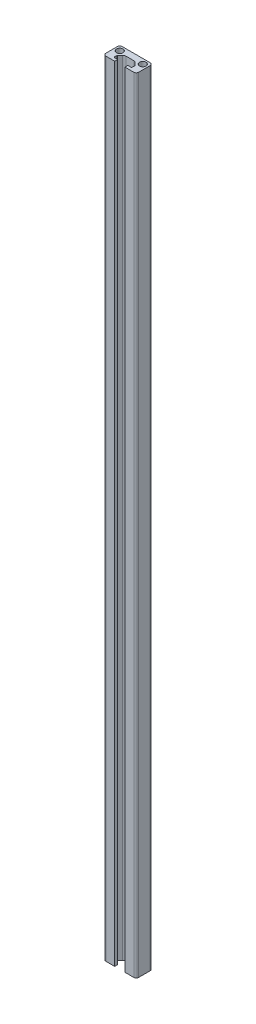
ISO-10303-21;
HEADER;
FILE_DESCRIPTION(('STEP AP214'),'2;1');
FILE_NAME('part.step','',(''),(''),'','','');
FILE_SCHEMA(('AUTOMOTIVE_DESIGN { 1 0 10303 214 1 1 1 1 }'));
ENDSEC;
DATA;
#1=APPLICATION_CONTEXT('core data for automotive mechanical design processes');
#2=APPLICATION_PROTOCOL_DEFINITION('international standard','automotive_design',2000,#1);
#3=PRODUCT_CONTEXT('',#1,'mechanical');
#4=PRODUCT('Part','Part','',(#3));
#5=PRODUCT_RELATED_PRODUCT_CATEGORY('part','',(#4));
#6=PRODUCT_DEFINITION_FORMATION('','',#4);
#7=PRODUCT_DEFINITION_CONTEXT('part definition',#1,'design');
#8=PRODUCT_DEFINITION('design','',#6,#7);
#9=PRODUCT_DEFINITION_SHAPE('','',#8);
#10=(LENGTH_UNIT() NAMED_UNIT(*) SI_UNIT(.MILLI.,.METRE.));
#11=(NAMED_UNIT(*) PLANE_ANGLE_UNIT() SI_UNIT($,.RADIAN.));
#12=(NAMED_UNIT(*) SI_UNIT($,.STERADIAN.) SOLID_ANGLE_UNIT());
#13=UNCERTAINTY_MEASURE_WITH_UNIT(LENGTH_MEASURE(1.E-05),#10,'distance_accuracy_value','');
#14=(GEOMETRIC_REPRESENTATION_CONTEXT(3) GLOBAL_UNCERTAINTY_ASSIGNED_CONTEXT((#13)) GLOBAL_UNIT_ASSIGNED_CONTEXT((#10,
#11,#12)) REPRESENTATION_CONTEXT('',''));
#15=CARTESIAN_POINT('',(0.,0.,0.));
#16=DIRECTION('',(0.,0.,1.));
#17=DIRECTION('',(1.,0.,0.));
#18=AXIS2_PLACEMENT_3D('',#15,#16,#17);
#19=CARTESIAN_POINT('',(-3.1,-238.5,0.));
#20=DIRECTION('',(1.,0.,0.));
#21=DIRECTION('',(0.,0.,-1.));
#22=AXIS2_PLACEMENT_3D('',#19,#20,#21);
#23=PLANE('',#22);
#24=DIRECTION('',(0.,0.,-1.));
#25=VECTOR('',#24,1.);
#26=CARTESIAN_POINT('',(-3.1,238.5,0.));
#27=LINE('',#26,#25);
#28=CARTESIAN_POINT('',(-3.1,238.5,0.));
#29=VERTEX_POINT('',#28);
#30=CARTESIAN_POINT('',(-3.1,238.5,-1.8));
#31=VERTEX_POINT('',#30);
#32=EDGE_CURVE('E230',#29,#31,#27,.T.);
#33=ORIENTED_EDGE('',*,*,#32,.F.);
#34=DIRECTION('',(0.,1.,0.));
#35=VECTOR('',#34,1.);
#36=CARTESIAN_POINT('',(-3.1,-238.5,0.));
#37=LINE('',#36,#35);
#38=CARTESIAN_POINT('',(-3.1,-238.5,0.));
#39=VERTEX_POINT('',#38);
#40=EDGE_CURVE('E11',#39,#29,#37,.T.);
#41=ORIENTED_EDGE('',*,*,#40,.F.);
#42=DIRECTION('',(0.,0.,-1.));
#43=VECTOR('',#42,1.);
#44=CARTESIAN_POINT('',(-3.1,-238.5,0.));
#45=LINE('',#44,#43);
#46=CARTESIAN_POINT('',(-3.1,-238.5,-1.8));
#47=VERTEX_POINT('',#46);
#48=EDGE_CURVE('E299',#39,#47,#45,.T.);
#49=ORIENTED_EDGE('',*,*,#48,.T.);
#50=DIRECTION('',(0.,1.,0.));
#51=VECTOR('',#50,1.);
#52=CARTESIAN_POINT('',(-3.1,-238.5,-1.8));
#53=LINE('',#52,#51);
#54=EDGE_CURVE('E40',#47,#31,#53,.T.);
#55=ORIENTED_EDGE('',*,*,#54,.T.);
#56=EDGE_LOOP('',(#33,#41,#49,#55));
#57=FACE_BOUND('',#56,.T.);
#58=ADVANCED_FACE('F37',(#57),#23,.T.);
#59=CARTESIAN_POINT('',(-8.5,-238.5,0.));
#60=DIRECTION('',(0.,0.,1.));
#61=DIRECTION('',(1.,0.,0.));
#62=AXIS2_PLACEMENT_3D('',#59,#60,#61);
#63=PLANE('',#62);
#64=DIRECTION('',(1.,0.,0.));
#65=VECTOR('',#64,1.);
#66=CARTESIAN_POINT('',(-8.5,238.5,0.));
#67=LINE('',#66,#65);
#68=CARTESIAN_POINT('',(-8.5,238.5,0.));
#69=VERTEX_POINT('',#68);
#70=EDGE_CURVE('E297',#69,#29,#67,.T.);
#71=ORIENTED_EDGE('',*,*,#70,.F.);
#72=DIRECTION('',(0.,1.,0.));
#73=VECTOR('',#72,1.);
#74=CARTESIAN_POINT('',(-8.5,-238.5,0.));
#75=LINE('',#74,#73);
#76=CARTESIAN_POINT('',(-8.5,-238.5,0.));
#77=VERTEX_POINT('',#76);
#78=EDGE_CURVE('E46',#77,#69,#75,.T.);
#79=ORIENTED_EDGE('',*,*,#78,.F.);
#80=DIRECTION('',(1.,0.,0.));
#81=VECTOR('',#80,1.);
#82=CARTESIAN_POINT('',(-8.5,-238.5,0.));
#83=LINE('',#82,#81);
#84=EDGE_CURVE('E220',#77,#39,#83,.T.);
#85=ORIENTED_EDGE('',*,*,#84,.T.);
#86=ORIENTED_EDGE('',*,*,#40,.T.);
#87=EDGE_LOOP('',(#71,#79,#85,#86));
#88=FACE_BOUND('',#87,.T.);
#89=ADVANCED_FACE('F343',(#88),#63,.T.);
#90=CARTESIAN_POINT('',(-8.5,-238.5,-1.5));
#91=DIRECTION('',(0.,1.,0.));
#92=DIRECTION('',(0.,0.,1.));
#93=AXIS2_PLACEMENT_3D('',#90,#91,#92);
#94=CYLINDRICAL_SURFACE('',#93,1.5);
#95=CARTESIAN_POINT('',(-8.5,238.5,-1.5));
#96=DIRECTION('',(0.,1.,0.));
#97=DIRECTION('',(0.,0.,1.));
#98=AXIS2_PLACEMENT_3D('',#95,#96,#97);
#99=CIRCLE('',#98,1.5);
#100=CARTESIAN_POINT('',(-10.,238.5,-1.5));
#101=VERTEX_POINT('',#100);
#102=EDGE_CURVE('E207',#101,#69,#99,.T.);
#103=ORIENTED_EDGE('',*,*,#102,.F.);
#104=DIRECTION('',(0.,1.,0.));
#105=VECTOR('',#104,1.);
#106=CARTESIAN_POINT('',(-10.,-238.5,-1.5));
#107=LINE('',#106,#105);
#108=CARTESIAN_POINT('',(-10.,-238.5,-1.5));
#109=VERTEX_POINT('',#108);
#110=EDGE_CURVE('E202',#109,#101,#107,.T.);
#111=ORIENTED_EDGE('',*,*,#110,.F.);
#112=CARTESIAN_POINT('',(-8.5,-238.5,-1.5));
#113=DIRECTION('',(0.,1.,0.));
#114=DIRECTION('',(0.,0.,1.));
#115=AXIS2_PLACEMENT_3D('',#112,#113,#114);
#116=CIRCLE('',#115,1.5);
#117=EDGE_CURVE('E205',#109,#77,#116,.T.);
#118=ORIENTED_EDGE('',*,*,#117,.T.);
#119=ORIENTED_EDGE('',*,*,#78,.T.);
#120=EDGE_LOOP('',(#103,#111,#118,#119));
#121=FACE_BOUND('',#120,.T.);
#122=ADVANCED_FACE('F204',(#121),#94,.T.);
#123=CARTESIAN_POINT('',(-10.,-238.5,-8.5));
#124=DIRECTION('',(-1.,0.,0.));
#125=DIRECTION('',(0.,0.,1.));
#126=AXIS2_PLACEMENT_3D('',#123,#124,#125);
#127=PLANE('',#126);
#128=DIRECTION('',(0.,0.,1.));
#129=VECTOR('',#128,1.);
#130=CARTESIAN_POINT('',(-10.,238.5,-8.5));
#131=LINE('',#130,#129);
#132=CARTESIAN_POINT('',(-10.,238.5,-8.5));
#133=VERTEX_POINT('',#132);
#134=EDGE_CURVE('E294',#133,#101,#131,.T.);
#135=ORIENTED_EDGE('',*,*,#134,.F.);
#136=DIRECTION('',(0.,1.,0.));
#137=VECTOR('',#136,1.);
#138=CARTESIAN_POINT('',(-10.,-238.5,-8.5));
#139=LINE('',#138,#137);
#140=CARTESIAN_POINT('',(-10.,-238.5,-8.5));
#141=VERTEX_POINT('',#140);
#142=EDGE_CURVE('E212',#141,#133,#139,.T.);
#143=ORIENTED_EDGE('',*,*,#142,.F.);
#144=DIRECTION('',(0.,0.,1.));
#145=VECTOR('',#144,1.);
#146=CARTESIAN_POINT('',(-10.,-238.5,-8.5));
#147=LINE('',#146,#145);
#148=EDGE_CURVE('E218',#141,#109,#147,.T.);
#149=ORIENTED_EDGE('',*,*,#148,.T.);
#150=ORIENTED_EDGE('',*,*,#110,.T.);
#151=EDGE_LOOP('',(#135,#143,#149,#150));
#152=FACE_BOUND('',#151,.T.);
#153=ADVANCED_FACE('F222',(#152),#127,.T.);
#154=CARTESIAN_POINT('',(-8.5,-238.5,-8.5));
#155=DIRECTION('',(0.,1.,0.));
#156=DIRECTION('',(0.,0.,1.));
#157=AXIS2_PLACEMENT_3D('',#154,#155,#156);
#158=CYLINDRICAL_SURFACE('',#157,1.5);
#159=CARTESIAN_POINT('',(-8.5,238.5,-8.5));
#160=DIRECTION('',(0.,1.,0.));
#161=DIRECTION('',(0.,0.,1.));
#162=AXIS2_PLACEMENT_3D('',#159,#160,#161);
#163=CIRCLE('',#162,1.5);
#164=CARTESIAN_POINT('',(-8.5,238.5,-10.));
#165=VERTEX_POINT('',#164);
#166=EDGE_CURVE('E291',#165,#133,#163,.T.);
#167=ORIENTED_EDGE('',*,*,#166,.F.);
#168=DIRECTION('',(0.,1.,0.));
#169=VECTOR('',#168,1.);
#170=CARTESIAN_POINT('',(-8.5,-238.5,-10.));
#171=LINE('',#170,#169);
#172=CARTESIAN_POINT('',(-8.5,-238.5,-10.));
#173=VERTEX_POINT('',#172);
#174=EDGE_CURVE('E303',#173,#165,#171,.T.);
#175=ORIENTED_EDGE('',*,*,#174,.F.);
#176=CARTESIAN_POINT('',(-8.5,-238.5,-8.5));
#177=DIRECTION('',(0.,1.,0.));
#178=DIRECTION('',(0.,0.,1.));
#179=AXIS2_PLACEMENT_3D('',#176,#177,#178);
#180=CIRCLE('',#179,1.5);
#181=EDGE_CURVE('E223',#173,#141,#180,.T.);
#182=ORIENTED_EDGE('',*,*,#181,.T.);
#183=ORIENTED_EDGE('',*,*,#142,.T.);
#184=EDGE_LOOP('',(#167,#175,#182,#183));
#185=FACE_BOUND('',#184,.T.);
#186=ADVANCED_FACE('F356',(#185),#158,.T.);
#187=CARTESIAN_POINT('',(8.5,-238.5,-10.));
#188=DIRECTION('',(0.,0.,-1.));
#189=DIRECTION('',(-1.,0.,0.));
#190=AXIS2_PLACEMENT_3D('',#187,#188,#189);
#191=PLANE('',#190);
#192=DIRECTION('',(-1.,0.,0.));
#193=VECTOR('',#192,1.);
#194=CARTESIAN_POINT('',(8.5,238.5,-10.));
#195=LINE('',#194,#193);
#196=CARTESIAN_POINT('',(8.5,238.5,-10.));
#197=VERTEX_POINT('',#196);
#198=EDGE_CURVE('E288',#197,#165,#195,.T.);
#199=ORIENTED_EDGE('',*,*,#198,.F.);
#200=DIRECTION('',(0.,1.,0.));
#201=VECTOR('',#200,1.);
#202=CARTESIAN_POINT('',(8.5,-238.5,-10.));
#203=LINE('',#202,#201);
#204=CARTESIAN_POINT('',(8.5,-238.5,-10.));
#205=VERTEX_POINT('',#204);
#206=EDGE_CURVE('E305',#205,#197,#203,.T.);
#207=ORIENTED_EDGE('',*,*,#206,.F.);
#208=DIRECTION('',(-1.,0.,0.));
#209=VECTOR('',#208,1.);
#210=CARTESIAN_POINT('',(8.5,-238.5,-10.));
#211=LINE('',#210,#209);
#212=EDGE_CURVE('E225',#205,#173,#211,.T.);
#213=ORIENTED_EDGE('',*,*,#212,.T.);
#214=ORIENTED_EDGE('',*,*,#174,.T.);
#215=EDGE_LOOP('',(#199,#207,#213,#214));
#216=FACE_BOUND('',#215,.T.);
#217=ADVANCED_FACE('F359',(#216),#191,.T.);
#218=CARTESIAN_POINT('',(8.5,-238.5,-8.5));
#219=DIRECTION('',(0.,1.,0.));
#220=DIRECTION('',(0.,0.,1.));
#221=AXIS2_PLACEMENT_3D('',#218,#219,#220);
#222=CYLINDRICAL_SURFACE('',#221,1.5);
#223=CARTESIAN_POINT('',(8.5,238.5,-8.5));
#224=DIRECTION('',(0.,1.,0.));
#225=DIRECTION('',(0.,0.,1.));
#226=AXIS2_PLACEMENT_3D('',#223,#224,#225);
#227=CIRCLE('',#226,1.5);
#228=CARTESIAN_POINT('',(10.,238.5,-8.5));
#229=VERTEX_POINT('',#228);
#230=EDGE_CURVE('E285',#229,#197,#227,.T.);
#231=ORIENTED_EDGE('',*,*,#230,.F.);
#232=DIRECTION('',(0.,1.,0.));
#233=VECTOR('',#232,1.);
#234=CARTESIAN_POINT('',(10.,-238.5,-8.5));
#235=LINE('',#234,#233);
#236=CARTESIAN_POINT('',(10.,-238.5,-8.5));
#237=VERTEX_POINT('',#236);
#238=EDGE_CURVE('E307',#237,#229,#235,.T.);
#239=ORIENTED_EDGE('',*,*,#238,.F.);
#240=CARTESIAN_POINT('',(8.5,-238.5,-8.5));
#241=DIRECTION('',(0.,1.,0.));
#242=DIRECTION('',(0.,0.,1.));
#243=AXIS2_PLACEMENT_3D('',#240,#241,#242);
#244=CIRCLE('',#243,1.5);
#245=EDGE_CURVE('E517',#237,#205,#244,.T.);
#246=ORIENTED_EDGE('',*,*,#245,.T.);
#247=ORIENTED_EDGE('',*,*,#206,.T.);
#248=EDGE_LOOP('',(#231,#239,#246,#247));
#249=FACE_BOUND('',#248,.T.);
#250=ADVANCED_FACE('F363',(#249),#222,.T.);
#251=CARTESIAN_POINT('',(10.,-238.5,-1.5));
#252=DIRECTION('',(1.,0.,0.));
#253=DIRECTION('',(0.,0.,-1.));
#254=AXIS2_PLACEMENT_3D('',#251,#252,#253);
#255=PLANE('',#254);
#256=DIRECTION('',(0.,0.,-1.));
#257=VECTOR('',#256,1.);
#258=CARTESIAN_POINT('',(10.,238.5,-1.5));
#259=LINE('',#258,#257);
#260=CARTESIAN_POINT('',(10.,238.5,-1.5));
#261=VERTEX_POINT('',#260);
#262=EDGE_CURVE('E282',#261,#229,#259,.T.);
#263=ORIENTED_EDGE('',*,*,#262,.F.);
#264=DIRECTION('',(0.,1.,0.));
#265=VECTOR('',#264,1.);
#266=CARTESIAN_POINT('',(10.,-238.5,-1.5));
#267=LINE('',#266,#265);
#268=CARTESIAN_POINT('',(10.,-238.5,-1.5));
#269=VERTEX_POINT('',#268);
#270=EDGE_CURVE('E309',#269,#261,#267,.T.);
#271=ORIENTED_EDGE('',*,*,#270,.F.);
#272=DIRECTION('',(0.,0.,-1.));
#273=VECTOR('',#272,1.);
#274=CARTESIAN_POINT('',(10.,-238.5,-1.5));
#275=LINE('',#274,#273);
#276=EDGE_CURVE('E514',#269,#237,#275,.T.);
#277=ORIENTED_EDGE('',*,*,#276,.T.);
#278=ORIENTED_EDGE('',*,*,#238,.T.);
#279=EDGE_LOOP('',(#263,#271,#277,#278));
#280=FACE_BOUND('',#279,.T.);
#281=ADVANCED_FACE('F367',(#280),#255,.T.);
#282=CARTESIAN_POINT('',(8.5,-238.5,-1.5));
#283=DIRECTION('',(0.,1.,0.));
#284=DIRECTION('',(0.,0.,1.));
#285=AXIS2_PLACEMENT_3D('',#282,#283,#284);
#286=CYLINDRICAL_SURFACE('',#285,1.5);
#287=CARTESIAN_POINT('',(8.5,238.5,-1.5));
#288=DIRECTION('',(0.,1.,0.));
#289=DIRECTION('',(0.,0.,1.));
#290=AXIS2_PLACEMENT_3D('',#287,#288,#289);
#291=CIRCLE('',#290,1.5);
#292=CARTESIAN_POINT('',(8.5,238.5,0.));
#293=VERTEX_POINT('',#292);
#294=EDGE_CURVE('E279',#293,#261,#291,.T.);
#295=ORIENTED_EDGE('',*,*,#294,.F.);
#296=DIRECTION('',(0.,1.,0.));
#297=VECTOR('',#296,1.);
#298=CARTESIAN_POINT('',(8.5,-238.5,0.));
#299=LINE('',#298,#297);
#300=CARTESIAN_POINT('',(8.5,-238.5,0.));
#301=VERTEX_POINT('',#300);
#302=EDGE_CURVE('E311',#301,#293,#299,.T.);
#303=ORIENTED_EDGE('',*,*,#302,.F.);
#304=CARTESIAN_POINT('',(8.5,-238.5,-1.5));
#305=DIRECTION('',(0.,1.,0.));
#306=DIRECTION('',(0.,0.,1.));
#307=AXIS2_PLACEMENT_3D('',#304,#305,#306);
#308=CIRCLE('',#307,1.5);
#309=EDGE_CURVE('E511',#301,#269,#308,.T.);
#310=ORIENTED_EDGE('',*,*,#309,.T.);
#311=ORIENTED_EDGE('',*,*,#270,.T.);
#312=EDGE_LOOP('',(#295,#303,#310,#311));
#313=FACE_BOUND('',#312,.T.);
#314=ADVANCED_FACE('F371',(#313),#286,.T.);
#315=CARTESIAN_POINT('',(3.1,-238.5,0.));
#316=DIRECTION('',(0.,0.,1.));
#317=DIRECTION('',(1.,0.,0.));
#318=AXIS2_PLACEMENT_3D('',#315,#316,#317);
#319=PLANE('',#318);
#320=DIRECTION('',(1.,0.,0.));
#321=VECTOR('',#320,1.);
#322=CARTESIAN_POINT('',(3.1,238.5,0.));
#323=LINE('',#322,#321);
#324=CARTESIAN_POINT('',(3.1,238.5,0.));
#325=VERTEX_POINT('',#324);
#326=EDGE_CURVE('E276',#325,#293,#323,.T.);
#327=ORIENTED_EDGE('',*,*,#326,.F.);
#328=DIRECTION('',(0.,1.,0.));
#329=VECTOR('',#328,1.);
#330=CARTESIAN_POINT('',(3.1,-238.5,0.));
#331=LINE('',#330,#329);
#332=CARTESIAN_POINT('',(3.1,-238.5,0.));
#333=VERTEX_POINT('',#332);
#334=EDGE_CURVE('E313',#333,#325,#331,.T.);
#335=ORIENTED_EDGE('',*,*,#334,.F.);
#336=DIRECTION('',(1.,0.,0.));
#337=VECTOR('',#336,1.);
#338=CARTESIAN_POINT('',(3.1,-238.5,0.));
#339=LINE('',#338,#337);
#340=EDGE_CURVE('E508',#333,#301,#339,.T.);
#341=ORIENTED_EDGE('',*,*,#340,.T.);
#342=ORIENTED_EDGE('',*,*,#302,.T.);
#343=EDGE_LOOP('',(#327,#335,#341,#342));
#344=FACE_BOUND('',#343,.T.);
#345=ADVANCED_FACE('F375',(#344),#319,.T.);
#346=CARTESIAN_POINT('',(3.1,-238.5,-1.8));
#347=DIRECTION('',(-1.,0.,0.));
#348=DIRECTION('',(0.,0.,1.));
#349=AXIS2_PLACEMENT_3D('',#346,#347,#348);
#350=PLANE('',#349);
#351=DIRECTION('',(0.,0.,1.));
#352=VECTOR('',#351,1.);
#353=CARTESIAN_POINT('',(3.1,238.5,-1.8));
#354=LINE('',#353,#352);
#355=CARTESIAN_POINT('',(3.1,238.5,-1.8));
#356=VERTEX_POINT('',#355);
#357=EDGE_CURVE('E273',#356,#325,#354,.T.);
#358=ORIENTED_EDGE('',*,*,#357,.F.);
#359=DIRECTION('',(0.,1.,0.));
#360=VECTOR('',#359,1.);
#361=CARTESIAN_POINT('',(3.1,-238.5,-1.8));
#362=LINE('',#361,#360);
#363=CARTESIAN_POINT('',(3.1,-238.5,-1.8));
#364=VERTEX_POINT('',#363);
#365=EDGE_CURVE('E315',#364,#356,#362,.T.);
#366=ORIENTED_EDGE('',*,*,#365,.F.);
#367=DIRECTION('',(0.,0.,1.));
#368=VECTOR('',#367,1.);
#369=CARTESIAN_POINT('',(3.1,-238.5,-1.8));
#370=LINE('',#369,#368);
#371=EDGE_CURVE('E505',#364,#333,#370,.T.);
#372=ORIENTED_EDGE('',*,*,#371,.T.);
#373=ORIENTED_EDGE('',*,*,#334,.T.);
#374=EDGE_LOOP('',(#358,#366,#372,#373));
#375=FACE_BOUND('',#374,.T.);
#376=ADVANCED_FACE('F379',(#375),#350,.T.);
#377=CARTESIAN_POINT('',(4.95,-238.5,-1.8));
#378=DIRECTION('',(0.,0.,-1.));
#379=DIRECTION('',(-1.,0.,0.));
#380=AXIS2_PLACEMENT_3D('',#377,#378,#379);
#381=PLANE('',#380);
#382=DIRECTION('',(-1.,0.,0.));
#383=VECTOR('',#382,1.);
#384=CARTESIAN_POINT('',(4.95,238.5,-1.8));
#385=LINE('',#384,#383);
#386=CARTESIAN_POINT('',(4.95,238.5,-1.8));
#387=VERTEX_POINT('',#386);
#388=EDGE_CURVE('E270',#387,#356,#385,.T.);
#389=ORIENTED_EDGE('',*,*,#388,.F.);
#390=DIRECTION('',(0.,1.,0.));
#391=VECTOR('',#390,1.);
#392=CARTESIAN_POINT('',(4.95,-238.5,-1.8));
#393=LINE('',#392,#391);
#394=CARTESIAN_POINT('',(4.95,-238.5,-1.8));
#395=VERTEX_POINT('',#394);
#396=EDGE_CURVE('E317',#395,#387,#393,.T.);
#397=ORIENTED_EDGE('',*,*,#396,.F.);
#398=DIRECTION('',(-1.,0.,0.));
#399=VECTOR('',#398,1.);
#400=CARTESIAN_POINT('',(4.95,-238.5,-1.8));
#401=LINE('',#400,#399);
#402=EDGE_CURVE('E502',#395,#364,#401,.T.);
#403=ORIENTED_EDGE('',*,*,#402,.T.);
#404=ORIENTED_EDGE('',*,*,#365,.T.);
#405=EDGE_LOOP('',(#389,#397,#403,#404));
#406=FACE_BOUND('',#405,.T.);
#407=ADVANCED_FACE('F383',(#406),#381,.T.);
#408=CARTESIAN_POINT('',(4.95,-238.5,-2.3));
#409=DIRECTION('',(0.,1.,0.));
#410=DIRECTION('',(0.,0.,1.));
#411=AXIS2_PLACEMENT_3D('',#408,#409,#410);
#412=CYLINDRICAL_SURFACE('',#411,0.5);
#413=CARTESIAN_POINT('',(4.95,238.5,-2.3));
#414=DIRECTION('',(0.,-1.,0.));
#415=DIRECTION('',(0.,0.,-1.));
#416=AXIS2_PLACEMENT_3D('',#413,#414,#415);
#417=CIRCLE('',#416,0.5);
#418=CARTESIAN_POINT('',(5.45,238.5,-2.3));
#419=VERTEX_POINT('',#418);
#420=EDGE_CURVE('E267',#419,#387,#417,.T.);
#421=ORIENTED_EDGE('',*,*,#420,.F.);
#422=DIRECTION('',(0.,1.,0.));
#423=VECTOR('',#422,1.);
#424=CARTESIAN_POINT('',(5.45,-238.5,-2.3));
#425=LINE('',#424,#423);
#426=CARTESIAN_POINT('',(5.45,-238.5,-2.3));
#427=VERTEX_POINT('',#426);
#428=EDGE_CURVE('E319',#427,#419,#425,.T.);
#429=ORIENTED_EDGE('',*,*,#428,.F.);
#430=CARTESIAN_POINT('',(4.95,-238.5,-2.3));
#431=DIRECTION('',(0.,-1.,0.));
#432=DIRECTION('',(0.,0.,-1.));
#433=AXIS2_PLACEMENT_3D('',#430,#431,#432);
#434=CIRCLE('',#433,0.5);
#435=EDGE_CURVE('E499',#427,#395,#434,.T.);
#436=ORIENTED_EDGE('',*,*,#435,.T.);
#437=ORIENTED_EDGE('',*,*,#396,.T.);
#438=EDGE_LOOP('',(#421,#429,#436,#437));
#439=FACE_BOUND('',#438,.T.);
#440=ADVANCED_FACE('F387',(#439),#412,.F.);
#441=CARTESIAN_POINT('',(5.45,-238.5,-3.69289321881345));
#442=DIRECTION('',(-1.,0.,0.));
#443=DIRECTION('',(0.,0.,1.));
#444=AXIS2_PLACEMENT_3D('',#441,#442,#443);
#445=PLANE('',#444);
#446=DIRECTION('',(0.,0.,1.));
#447=VECTOR('',#446,1.);
#448=CARTESIAN_POINT('',(5.45,238.5,-3.69289321881345));
#449=LINE('',#448,#447);
#450=CARTESIAN_POINT('',(5.45,238.5,-3.69289321881345));
#451=VERTEX_POINT('',#450);
#452=EDGE_CURVE('E264',#451,#419,#449,.T.);
#453=ORIENTED_EDGE('',*,*,#452,.F.);
#454=DIRECTION('',(0.,1.,0.));
#455=VECTOR('',#454,1.);
#456=CARTESIAN_POINT('',(5.45,-238.5,-3.69289321881345));
#457=LINE('',#456,#455);
#458=CARTESIAN_POINT('',(5.45,-238.5,-3.69289321881345));
#459=VERTEX_POINT('',#458);
#460=EDGE_CURVE('E321',#459,#451,#457,.T.);
#461=ORIENTED_EDGE('',*,*,#460,.F.);
#462=DIRECTION('',(0.,0.,1.));
#463=VECTOR('',#462,1.);
#464=CARTESIAN_POINT('',(5.45,-238.5,-3.69289321881345));
#465=LINE('',#464,#463);
#466=EDGE_CURVE('E496',#459,#427,#465,.T.);
#467=ORIENTED_EDGE('',*,*,#466,.T.);
#468=ORIENTED_EDGE('',*,*,#428,.T.);
#469=EDGE_LOOP('',(#453,#461,#467,#468));
#470=FACE_BOUND('',#469,.T.);
#471=ADVANCED_FACE('F391',(#470),#445,.T.);
#472=CARTESIAN_POINT('',(4.95,-238.5,-3.69289321881345));
#473=DIRECTION('',(0.,1.,0.));
#474=DIRECTION('',(0.,0.,1.));
#475=AXIS2_PLACEMENT_3D('',#472,#473,#474);
#476=CYLINDRICAL_SURFACE('',#475,0.499999999999999);
#477=CARTESIAN_POINT('',(4.95,238.5,-3.69289321881345));
#478=DIRECTION('',(0.,-1.,0.));
#479=DIRECTION('',(0.,0.,-1.));
#480=AXIS2_PLACEMENT_3D('',#477,#478,#479);
#481=CIRCLE('',#480,0.499999999999999);
#482=CARTESIAN_POINT('',(5.30355339059327,238.5,-4.04644660940673));
#483=VERTEX_POINT('',#482);
#484=EDGE_CURVE('E261',#483,#451,#481,.T.);
#485=ORIENTED_EDGE('',*,*,#484,.F.);
#486=DIRECTION('',(0.,1.,0.));
#487=VECTOR('',#486,1.);
#488=CARTESIAN_POINT('',(5.30355339059327,-238.5,-4.04644660940673));
#489=LINE('',#488,#487);
#490=CARTESIAN_POINT('',(5.30355339059327,-238.5,-4.04644660940673));
#491=VERTEX_POINT('',#490);
#492=EDGE_CURVE('E323',#491,#483,#489,.T.);
#493=ORIENTED_EDGE('',*,*,#492,.F.);
#494=CARTESIAN_POINT('',(4.95,-238.5,-3.69289321881345));
#495=DIRECTION('',(0.,-1.,0.));
#496=DIRECTION('',(0.,0.,-1.));
#497=AXIS2_PLACEMENT_3D('',#494,#495,#496);
#498=CIRCLE('',#497,0.499999999999999);
#499=EDGE_CURVE('E493',#491,#459,#498,.T.);
#500=ORIENTED_EDGE('',*,*,#499,.T.);
#501=ORIENTED_EDGE('',*,*,#460,.T.);
#502=EDGE_LOOP('',(#485,#493,#500,#501));
#503=FACE_BOUND('',#502,.T.);
#504=ADVANCED_FACE('F395',(#503),#476,.F.);
#505=CARTESIAN_POINT('',(3.83578643762691,-238.5,-5.5142135623731));
#506=DIRECTION('',(-0.70710678118655,0.,0.707106781186545));
#507=DIRECTION('',(0.707106781186545,0.,0.70710678118655));
#508=AXIS2_PLACEMENT_3D('',#505,#506,#507);
#509=PLANE('',#508);
#510=DIRECTION('',(0.707106781186545,0.,0.70710678118655));
#511=VECTOR('',#510,1.);
#512=CARTESIAN_POINT('',(3.83578643762691,238.5,-5.5142135623731));
#513=LINE('',#512,#511);
#514=CARTESIAN_POINT('',(3.8357864376269,238.5,-5.5142135623731));
#515=VERTEX_POINT('',#514);
#516=EDGE_CURVE('E258',#515,#483,#513,.T.);
#517=ORIENTED_EDGE('',*,*,#516,.F.);
#518=DIRECTION('',(0.,1.,0.));
#519=VECTOR('',#518,1.);
#520=CARTESIAN_POINT('',(3.8357864376269,-238.5,-5.5142135623731));
#521=LINE('',#520,#519);
#522=CARTESIAN_POINT('',(3.8357864376269,-238.5,-5.5142135623731));
#523=VERTEX_POINT('',#522);
#524=EDGE_CURVE('E325',#523,#515,#521,.T.);
#525=ORIENTED_EDGE('',*,*,#524,.F.);
#526=DIRECTION('',(0.707106781186545,0.,0.70710678118655));
#527=VECTOR('',#526,1.);
#528=CARTESIAN_POINT('',(3.83578643762691,-238.5,-5.5142135623731));
#529=LINE('',#528,#527);
#530=EDGE_CURVE('E490',#523,#491,#529,.T.);
#531=ORIENTED_EDGE('',*,*,#530,.T.);
#532=ORIENTED_EDGE('',*,*,#492,.T.);
#533=EDGE_LOOP('',(#517,#525,#531,#532));
#534=FACE_BOUND('',#533,.T.);
#535=ADVANCED_FACE('F399',(#534),#509,.T.);
#536=CARTESIAN_POINT('',(2.42157287525381,-238.5,-4.1));
#537=DIRECTION('',(0.,1.,0.));
#538=DIRECTION('',(0.,0.,1.));
#539=AXIS2_PLACEMENT_3D('',#536,#537,#538);
#540=CYLINDRICAL_SURFACE('',#539,2.);
#541=CARTESIAN_POINT('',(2.42157287525381,238.5,-4.1));
#542=DIRECTION('',(0.,-1.,0.));
#543=DIRECTION('',(0.,0.,-1.));
#544=AXIS2_PLACEMENT_3D('',#541,#542,#543);
#545=CIRCLE('',#544,2.);
#546=CARTESIAN_POINT('',(2.42157287525381,238.5,-6.1));
#547=VERTEX_POINT('',#546);
#548=EDGE_CURVE('E255',#547,#515,#545,.T.);
#549=ORIENTED_EDGE('',*,*,#548,.F.);
#550=DIRECTION('',(0.,1.,0.));
#551=VECTOR('',#550,1.);
#552=CARTESIAN_POINT('',(2.42157287525381,-238.5,-6.1));
#553=LINE('',#552,#551);
#554=CARTESIAN_POINT('',(2.42157287525381,-238.5,-6.1));
#555=VERTEX_POINT('',#554);
#556=EDGE_CURVE('E327',#555,#547,#553,.T.);
#557=ORIENTED_EDGE('',*,*,#556,.F.);
#558=CARTESIAN_POINT('',(2.42157287525381,-238.5,-4.1));
#559=DIRECTION('',(0.,-1.,0.));
#560=DIRECTION('',(0.,0.,-1.));
#561=AXIS2_PLACEMENT_3D('',#558,#559,#560);
#562=CIRCLE('',#561,2.);
#563=EDGE_CURVE('E487',#555,#523,#562,.T.);
#564=ORIENTED_EDGE('',*,*,#563,.T.);
#565=ORIENTED_EDGE('',*,*,#524,.T.);
#566=EDGE_LOOP('',(#549,#557,#564,#565));
#567=FACE_BOUND('',#566,.T.);
#568=ADVANCED_FACE('F403',(#567),#540,.F.);
#569=CARTESIAN_POINT('',(-2.42157287525381,-238.5,-6.1));
#570=DIRECTION('',(0.,0.,1.));
#571=DIRECTION('',(1.,0.,0.));
#572=AXIS2_PLACEMENT_3D('',#569,#570,#571);
#573=PLANE('',#572);
#574=DIRECTION('',(1.,0.,0.));
#575=VECTOR('',#574,1.);
#576=CARTESIAN_POINT('',(-2.42157287525381,238.5,-6.1));
#577=LINE('',#576,#575);
#578=CARTESIAN_POINT('',(-2.42157287525381,238.5,-6.1));
#579=VERTEX_POINT('',#578);
#580=EDGE_CURVE('E252',#579,#547,#577,.T.);
#581=ORIENTED_EDGE('',*,*,#580,.F.);
#582=DIRECTION('',(0.,1.,0.));
#583=VECTOR('',#582,1.);
#584=CARTESIAN_POINT('',(-2.42157287525381,-238.5,-6.1));
#585=LINE('',#584,#583);
#586=CARTESIAN_POINT('',(-2.42157287525381,-238.5,-6.1));
#587=VERTEX_POINT('',#586);
#588=EDGE_CURVE('E329',#587,#579,#585,.T.);
#589=ORIENTED_EDGE('',*,*,#588,.F.);
#590=DIRECTION('',(1.,0.,0.));
#591=VECTOR('',#590,1.);
#592=CARTESIAN_POINT('',(-2.42157287525381,-238.5,-6.1));
#593=LINE('',#592,#591);
#594=EDGE_CURVE('E484',#587,#555,#593,.T.);
#595=ORIENTED_EDGE('',*,*,#594,.T.);
#596=ORIENTED_EDGE('',*,*,#556,.T.);
#597=EDGE_LOOP('',(#581,#589,#595,#596));
#598=FACE_BOUND('',#597,.T.);
#599=ADVANCED_FACE('F407',(#598),#573,.T.);
#600=CARTESIAN_POINT('',(-2.42157287525381,-238.5,-4.1));
#601=DIRECTION('',(0.,1.,0.));
#602=DIRECTION('',(0.,0.,1.));
#603=AXIS2_PLACEMENT_3D('',#600,#601,#602);
#604=CYLINDRICAL_SURFACE('',#603,2.);
#605=CARTESIAN_POINT('',(-2.42157287525381,238.5,-4.1));
#606=DIRECTION('',(0.,-1.,0.));
#607=DIRECTION('',(0.,0.,-1.));
#608=AXIS2_PLACEMENT_3D('',#605,#606,#607);
#609=CIRCLE('',#608,2.);
#610=CARTESIAN_POINT('',(-3.83578643762691,238.5,-5.5142135623731));
#611=VERTEX_POINT('',#610);
#612=EDGE_CURVE('E249',#611,#579,#609,.T.);
#613=ORIENTED_EDGE('',*,*,#612,.F.);
#614=DIRECTION('',(0.,1.,0.));
#615=VECTOR('',#614,1.);
#616=CARTESIAN_POINT('',(-3.83578643762691,-238.5,-5.5142135623731));
#617=LINE('',#616,#615);
#618=CARTESIAN_POINT('',(-3.83578643762691,-238.5,-5.5142135623731));
#619=VERTEX_POINT('',#618);
#620=EDGE_CURVE('E331',#619,#611,#617,.T.);
#621=ORIENTED_EDGE('',*,*,#620,.F.);
#622=CARTESIAN_POINT('',(-2.42157287525381,-238.5,-4.1));
#623=DIRECTION('',(0.,-1.,0.));
#624=DIRECTION('',(0.,0.,-1.));
#625=AXIS2_PLACEMENT_3D('',#622,#623,#624);
#626=CIRCLE('',#625,2.);
#627=EDGE_CURVE('E481',#619,#587,#626,.T.);
#628=ORIENTED_EDGE('',*,*,#627,.T.);
#629=ORIENTED_EDGE('',*,*,#588,.T.);
#630=EDGE_LOOP('',(#613,#621,#628,#629));
#631=FACE_BOUND('',#630,.T.);
#632=ADVANCED_FACE('F411',(#631),#604,.F.);
#633=CARTESIAN_POINT('',(-5.30355339059327,-238.5,-4.04644660940673));
#634=DIRECTION('',(0.70710678118655,0.,0.707106781186545));
#635=DIRECTION('',(0.707106781186545,0.,-0.70710678118655));
#636=AXIS2_PLACEMENT_3D('',#633,#634,#635);
#637=PLANE('',#636);
#638=DIRECTION('',(0.707106781186545,0.,-0.70710678118655));
#639=VECTOR('',#638,1.);
#640=CARTESIAN_POINT('',(-5.30355339059327,238.5,-4.04644660940673));
#641=LINE('',#640,#639);
#642=CARTESIAN_POINT('',(-5.30355339059327,238.5,-4.04644660940673));
#643=VERTEX_POINT('',#642);
#644=EDGE_CURVE('E246',#643,#611,#641,.T.);
#645=ORIENTED_EDGE('',*,*,#644,.F.);
#646=DIRECTION('',(0.,1.,0.));
#647=VECTOR('',#646,1.);
#648=CARTESIAN_POINT('',(-5.30355339059327,-238.5,-4.04644660940673));
#649=LINE('',#648,#647);
#650=CARTESIAN_POINT('',(-5.30355339059327,-238.5,-4.04644660940673));
#651=VERTEX_POINT('',#650);
#652=EDGE_CURVE('E333',#651,#643,#649,.T.);
#653=ORIENTED_EDGE('',*,*,#652,.F.);
#654=DIRECTION('',(0.707106781186545,0.,-0.70710678118655));
#655=VECTOR('',#654,1.);
#656=CARTESIAN_POINT('',(-5.30355339059327,-238.5,-4.04644660940673));
#657=LINE('',#656,#655);
#658=EDGE_CURVE('E478',#651,#619,#657,.T.);
#659=ORIENTED_EDGE('',*,*,#658,.T.);
#660=ORIENTED_EDGE('',*,*,#620,.T.);
#661=EDGE_LOOP('',(#645,#653,#659,#660));
#662=FACE_BOUND('',#661,.T.);
#663=ADVANCED_FACE('F415',(#662),#637,.T.);
#664=CARTESIAN_POINT('',(-4.95,-238.5,-3.69289321881346));
#665=DIRECTION('',(0.,1.,0.));
#666=DIRECTION('',(0.,0.,1.));
#667=AXIS2_PLACEMENT_3D('',#664,#665,#666);
#668=CYLINDRICAL_SURFACE('',#667,0.499999999999997);
#669=CARTESIAN_POINT('',(-4.95,238.5,-3.69289321881346));
#670=DIRECTION('',(0.,-1.,0.));
#671=DIRECTION('',(0.,0.,-1.));
#672=AXIS2_PLACEMENT_3D('',#669,#670,#671);
#673=CIRCLE('',#672,0.499999999999997);
#674=CARTESIAN_POINT('',(-5.45,238.5,-3.69289321881346));
#675=VERTEX_POINT('',#674);
#676=EDGE_CURVE('E243',#675,#643,#673,.T.);
#677=ORIENTED_EDGE('',*,*,#676,.F.);
#678=DIRECTION('',(0.,1.,0.));
#679=VECTOR('',#678,1.);
#680=CARTESIAN_POINT('',(-5.45,-238.5,-3.69289321881346));
#681=LINE('',#680,#679);
#682=CARTESIAN_POINT('',(-5.45,-238.5,-3.69289321881346));
#683=VERTEX_POINT('',#682);
#684=EDGE_CURVE('E335',#683,#675,#681,.T.);
#685=ORIENTED_EDGE('',*,*,#684,.F.);
#686=CARTESIAN_POINT('',(-4.95,-238.5,-3.69289321881346));
#687=DIRECTION('',(0.,-1.,0.));
#688=DIRECTION('',(0.,0.,-1.));
#689=AXIS2_PLACEMENT_3D('',#686,#687,#688);
#690=CIRCLE('',#689,0.499999999999997);
#691=EDGE_CURVE('E475',#683,#651,#690,.T.);
#692=ORIENTED_EDGE('',*,*,#691,.T.);
#693=ORIENTED_EDGE('',*,*,#652,.T.);
#694=EDGE_LOOP('',(#677,#685,#692,#693));
#695=FACE_BOUND('',#694,.T.);
#696=ADVANCED_FACE('F419',(#695),#668,.F.);
#697=CARTESIAN_POINT('',(-5.45,-238.5,-2.3));
#698=DIRECTION('',(1.,0.,0.));
#699=DIRECTION('',(0.,0.,-1.));
#700=AXIS2_PLACEMENT_3D('',#697,#698,#699);
#701=PLANE('',#700);
#702=DIRECTION('',(0.,0.,-1.));
#703=VECTOR('',#702,1.);
#704=CARTESIAN_POINT('',(-5.45,238.5,-2.3));
#705=LINE('',#704,#703);
#706=CARTESIAN_POINT('',(-5.45,238.5,-2.3));
#707=VERTEX_POINT('',#706);
#708=EDGE_CURVE('E240',#707,#675,#705,.T.);
#709=ORIENTED_EDGE('',*,*,#708,.F.);
#710=DIRECTION('',(0.,1.,0.));
#711=VECTOR('',#710,1.);
#712=CARTESIAN_POINT('',(-5.45,-238.5,-2.3));
#713=LINE('',#712,#711);
#714=CARTESIAN_POINT('',(-5.45,-238.5,-2.3));
#715=VERTEX_POINT('',#714);
#716=EDGE_CURVE('E337',#715,#707,#713,.T.);
#717=ORIENTED_EDGE('',*,*,#716,.F.);
#718=DIRECTION('',(0.,0.,-1.));
#719=VECTOR('',#718,1.);
#720=CARTESIAN_POINT('',(-5.45,-238.5,-2.3));
#721=LINE('',#720,#719);
#722=EDGE_CURVE('E472',#715,#683,#721,.T.);
#723=ORIENTED_EDGE('',*,*,#722,.T.);
#724=ORIENTED_EDGE('',*,*,#684,.T.);
#725=EDGE_LOOP('',(#709,#717,#723,#724));
#726=FACE_BOUND('',#725,.T.);
#727=ADVANCED_FACE('F423',(#726),#701,.T.);
#728=CARTESIAN_POINT('',(-4.95,-238.5,-2.3));
#729=DIRECTION('',(0.,1.,0.));
#730=DIRECTION('',(0.,0.,1.));
#731=AXIS2_PLACEMENT_3D('',#728,#729,#730);
#732=CYLINDRICAL_SURFACE('',#731,0.5);
#733=CARTESIAN_POINT('',(-4.95,238.5,-2.3));
#734=DIRECTION('',(0.,-1.,0.));
#735=DIRECTION('',(0.,0.,-1.));
#736=AXIS2_PLACEMENT_3D('',#733,#734,#735);
#737=CIRCLE('',#736,0.5);
#738=CARTESIAN_POINT('',(-4.95,238.5,-1.8));
#739=VERTEX_POINT('',#738);
#740=EDGE_CURVE('E237',#739,#707,#737,.T.);
#741=ORIENTED_EDGE('',*,*,#740,.F.);
#742=DIRECTION('',(0.,1.,0.));
#743=VECTOR('',#742,1.);
#744=CARTESIAN_POINT('',(-4.95,-238.5,-1.8));
#745=LINE('',#744,#743);
#746=CARTESIAN_POINT('',(-4.95,-238.5,-1.8));
#747=VERTEX_POINT('',#746);
#748=EDGE_CURVE('E338',#747,#739,#745,.T.);
#749=ORIENTED_EDGE('',*,*,#748,.F.);
#750=CARTESIAN_POINT('',(-4.95,-238.5,-2.3));
#751=DIRECTION('',(0.,-1.,0.));
#752=DIRECTION('',(0.,0.,-1.));
#753=AXIS2_PLACEMENT_3D('',#750,#751,#752);
#754=CIRCLE('',#753,0.5);
#755=EDGE_CURVE('E469',#747,#715,#754,.T.);
#756=ORIENTED_EDGE('',*,*,#755,.T.);
#757=ORIENTED_EDGE('',*,*,#716,.T.);
#758=EDGE_LOOP('',(#741,#749,#756,#757));
#759=FACE_BOUND('',#758,.T.);
#760=ADVANCED_FACE('F427',(#759),#732,.F.);
#761=CARTESIAN_POINT('',(-3.1,-238.5,-1.8));
#762=DIRECTION('',(0.,0.,-1.));
#763=DIRECTION('',(-1.,0.,0.));
#764=AXIS2_PLACEMENT_3D('',#761,#762,#763);
#765=PLANE('',#764);
#766=DIRECTION('',(-1.,0.,0.));
#767=VECTOR('',#766,1.);
#768=CARTESIAN_POINT('',(-3.1,238.5,-1.8));
#769=LINE('',#768,#767);
#770=EDGE_CURVE('E233',#31,#739,#769,.T.);
#771=ORIENTED_EDGE('',*,*,#770,.F.);
#772=ORIENTED_EDGE('',*,*,#54,.F.);
#773=DIRECTION('',(-1.,0.,0.));
#774=VECTOR('',#773,1.);
#775=CARTESIAN_POINT('',(-3.1,-238.5,-1.8));
#776=LINE('',#775,#774);
#777=EDGE_CURVE('E467',#47,#747,#776,.T.);
#778=ORIENTED_EDGE('',*,*,#777,.T.);
#779=ORIENTED_EDGE('',*,*,#748,.T.);
#780=EDGE_LOOP('',(#771,#772,#778,#779));
#781=FACE_BOUND('',#780,.T.);
#782=ADVANCED_FACE('F340',(#781),#765,.T.);
#783=CARTESIAN_POINT('',(-4.95,-238.5,-2.3));
#784=DIRECTION('',(0.,-1.,0.));
#785=DIRECTION('',(0.,0.,-1.));
#786=AXIS2_PLACEMENT_3D('',#783,#784,#785);
#787=PLANE('',#786);
#788=CARTESIAN_POINT('',(7.,-238.5,-7.));
#789=DIRECTION('',(0.,1.,0.));
#790=DIRECTION('',(0.,0.,-1.));
#791=AXIS2_PLACEMENT_3D('',#788,#789,#790);
#792=CIRCLE('',#791,2.);
#793=CARTESIAN_POINT('',(7.,-238.5,-9.));
#794=VERTEX_POINT('',#793);
#795=EDGE_CURVE('E454',#794,#794,#792,.T.);
#796=ORIENTED_EDGE('',*,*,#795,.T.);
#797=EDGE_LOOP('',(#796));
#798=FACE_BOUND('',#797,.T.);
#799=CARTESIAN_POINT('',(-7.,-238.5,-7.));
#800=DIRECTION('',(0.,1.,0.));
#801=DIRECTION('',(0.,0.,-1.));
#802=AXIS2_PLACEMENT_3D('',#799,#800,#801);
#803=CIRCLE('',#802,2.);
#804=CARTESIAN_POINT('',(-7.,-238.5,-9.));
#805=VERTEX_POINT('',#804);
#806=EDGE_CURVE('E234',#805,#805,#803,.T.);
#807=ORIENTED_EDGE('',*,*,#806,.T.);
#808=EDGE_LOOP('',(#807));
#809=FACE_BOUND('',#808,.T.);
#810=ORIENTED_EDGE('',*,*,#48,.F.);
#811=ORIENTED_EDGE('',*,*,#84,.F.);
#812=ORIENTED_EDGE('',*,*,#117,.F.);
#813=ORIENTED_EDGE('',*,*,#148,.F.);
#814=ORIENTED_EDGE('',*,*,#181,.F.);
#815=ORIENTED_EDGE('',*,*,#212,.F.);
#816=ORIENTED_EDGE('',*,*,#245,.F.);
#817=ORIENTED_EDGE('',*,*,#276,.F.);
#818=ORIENTED_EDGE('',*,*,#309,.F.);
#819=ORIENTED_EDGE('',*,*,#340,.F.);
#820=ORIENTED_EDGE('',*,*,#371,.F.);
#821=ORIENTED_EDGE('',*,*,#402,.F.);
#822=ORIENTED_EDGE('',*,*,#435,.F.);
#823=ORIENTED_EDGE('',*,*,#466,.F.);
#824=ORIENTED_EDGE('',*,*,#499,.F.);
#825=ORIENTED_EDGE('',*,*,#530,.F.);
#826=ORIENTED_EDGE('',*,*,#563,.F.);
#827=ORIENTED_EDGE('',*,*,#594,.F.);
#828=ORIENTED_EDGE('',*,*,#627,.F.);
#829=ORIENTED_EDGE('',*,*,#658,.F.);
#830=ORIENTED_EDGE('',*,*,#691,.F.);
#831=ORIENTED_EDGE('',*,*,#722,.F.);
#832=ORIENTED_EDGE('',*,*,#755,.F.);
#833=ORIENTED_EDGE('',*,*,#777,.F.);
#834=EDGE_LOOP('',(#810,#811,#812,#813,#814,#815,#816,#817,#818,#819,#820,#821,#822,#823,#824,
#825,#826,#827,#828,#829,#830,#831,#832,#833));
#835=FACE_BOUND('',#834,.T.);
#836=ADVANCED_FACE('F216',(#798,#809,#835),#787,.T.);
#837=CARTESIAN_POINT('',(-4.95,238.5,-2.3));
#838=DIRECTION('',(0.,-1.,0.));
#839=DIRECTION('',(0.,0.,-1.));
#840=AXIS2_PLACEMENT_3D('',#837,#838,#839);
#841=PLANE('',#840);
#842=CARTESIAN_POINT('',(7.,238.5,-7.));
#843=DIRECTION('',(0.,1.,0.));
#844=DIRECTION('',(0.,0.,-1.));
#845=AXIS2_PLACEMENT_3D('',#842,#843,#844);
#846=CIRCLE('',#845,2.);
#847=CARTESIAN_POINT('',(7.,238.5,-9.));
#848=VERTEX_POINT('',#847);
#849=EDGE_CURVE('E457',#848,#848,#846,.T.);
#850=ORIENTED_EDGE('',*,*,#849,.F.);
#851=EDGE_LOOP('',(#850));
#852=FACE_BOUND('',#851,.T.);
#853=CARTESIAN_POINT('',(-7.,238.5,-7.));
#854=DIRECTION('',(0.,1.,0.));
#855=DIRECTION('',(0.,0.,-1.));
#856=AXIS2_PLACEMENT_3D('',#853,#854,#855);
#857=CIRCLE('',#856,2.);
#858=CARTESIAN_POINT('',(-7.,238.5,-9.));
#859=VERTEX_POINT('',#858);
#860=EDGE_CURVE('E459',#859,#859,#857,.T.);
#861=ORIENTED_EDGE('',*,*,#860,.F.);
#862=EDGE_LOOP('',(#861));
#863=FACE_BOUND('',#862,.T.);
#864=ORIENTED_EDGE('',*,*,#32,.T.);
#865=ORIENTED_EDGE('',*,*,#770,.T.);
#866=ORIENTED_EDGE('',*,*,#740,.T.);
#867=ORIENTED_EDGE('',*,*,#708,.T.);
#868=ORIENTED_EDGE('',*,*,#676,.T.);
#869=ORIENTED_EDGE('',*,*,#644,.T.);
#870=ORIENTED_EDGE('',*,*,#612,.T.);
#871=ORIENTED_EDGE('',*,*,#580,.T.);
#872=ORIENTED_EDGE('',*,*,#548,.T.);
#873=ORIENTED_EDGE('',*,*,#516,.T.);
#874=ORIENTED_EDGE('',*,*,#484,.T.);
#875=ORIENTED_EDGE('',*,*,#452,.T.);
#876=ORIENTED_EDGE('',*,*,#420,.T.);
#877=ORIENTED_EDGE('',*,*,#388,.T.);
#878=ORIENTED_EDGE('',*,*,#357,.T.);
#879=ORIENTED_EDGE('',*,*,#326,.T.);
#880=ORIENTED_EDGE('',*,*,#294,.T.);
#881=ORIENTED_EDGE('',*,*,#262,.T.);
#882=ORIENTED_EDGE('',*,*,#230,.T.);
#883=ORIENTED_EDGE('',*,*,#198,.T.);
#884=ORIENTED_EDGE('',*,*,#166,.T.);
#885=ORIENTED_EDGE('',*,*,#134,.T.);
#886=ORIENTED_EDGE('',*,*,#102,.T.);
#887=ORIENTED_EDGE('',*,*,#70,.T.);
#888=EDGE_LOOP('',(#864,#865,#866,#867,#868,#869,#870,#871,#872,#873,#874,#875,#876,#877,#878,
#879,#880,#881,#882,#883,#884,#885,#886,#887));
#889=FACE_BOUND('',#888,.T.);
#890=ADVANCED_FACE('F342',(#852,#863,#889),#841,.F.);
#891=CARTESIAN_POINT('',(-7.,-238.5,-7.));
#892=DIRECTION('',(0.,1.,0.));
#893=DIRECTION('',(0.,0.,1.));
#894=AXIS2_PLACEMENT_3D('',#891,#892,#893);
#895=CYLINDRICAL_SURFACE('',#894,2.);
#896=ORIENTED_EDGE('',*,*,#806,.F.);
#897=EDGE_LOOP('',(#896));
#898=FACE_BOUND('',#897,.T.);
#899=ORIENTED_EDGE('',*,*,#860,.T.);
#900=EDGE_LOOP('',(#899));
#901=FACE_BOUND('',#900,.T.);
#902=ADVANCED_FACE('F439',(#898,#901),#895,.F.);
#903=CARTESIAN_POINT('',(7.,-238.5,-7.));
#904=DIRECTION('',(0.,1.,0.));
#905=DIRECTION('',(0.,0.,1.));
#906=AXIS2_PLACEMENT_3D('',#903,#904,#905);
#907=CYLINDRICAL_SURFACE('',#906,2.);
#908=ORIENTED_EDGE('',*,*,#795,.F.);
#909=EDGE_LOOP('',(#908));
#910=FACE_BOUND('',#909,.T.);
#911=ORIENTED_EDGE('',*,*,#849,.T.);
#912=EDGE_LOOP('',(#911));
#913=FACE_BOUND('',#912,.T.);
#914=ADVANCED_FACE('F446',(#910,#913),#907,.F.);
#915=CLOSED_SHELL('',(#58,#89,#122,#153,#186,#217,#250,#281,#314,#345,#376,#407,#440,#471,#504,
#535,#568,#599,#632,#663,#696,#727,#760,#782,#836,#890,#902,#914));
#916=MANIFOLD_SOLID_BREP('B2',#915);
#917=ADVANCED_BREP_SHAPE_REPRESENTATION('',(#18,#916),#14);
#918=SHAPE_DEFINITION_REPRESENTATION(#9,#917);
ENDSEC;
END-ISO-10303-21;
